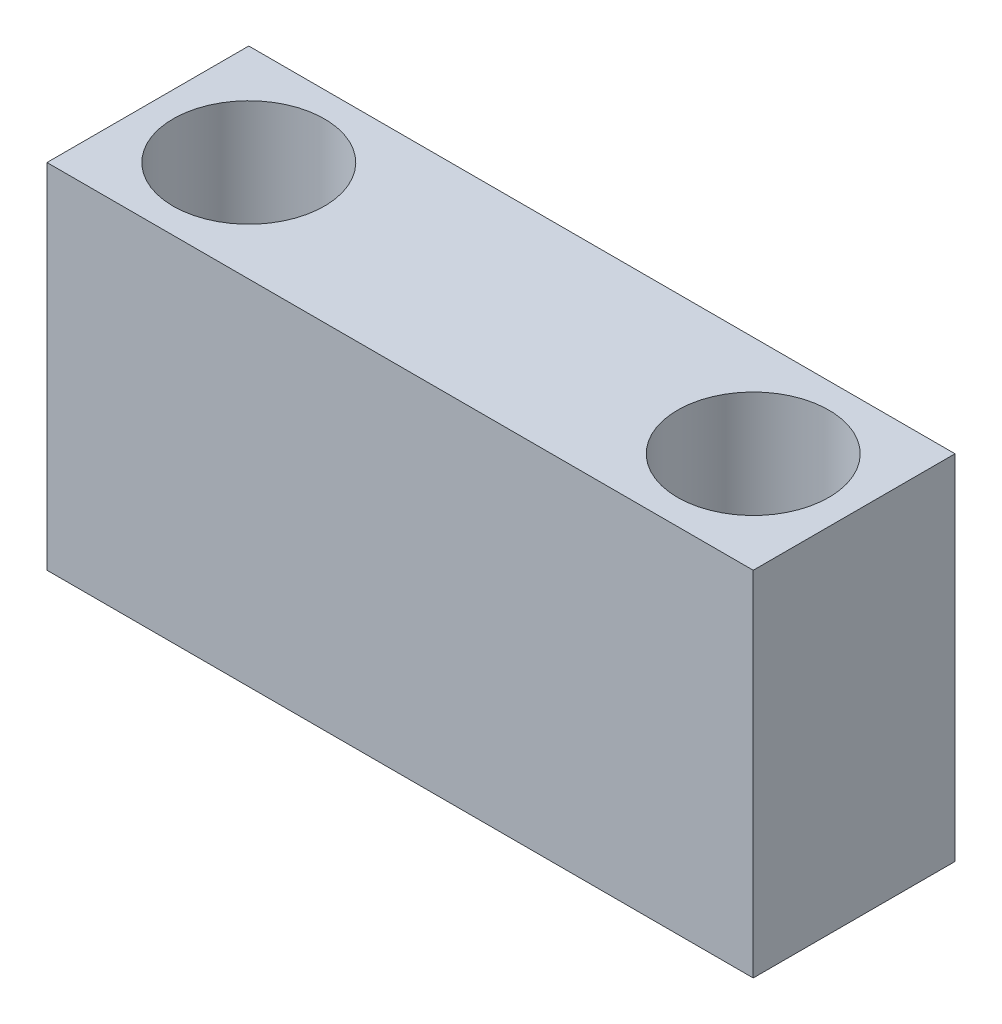
ISO-10303-21;
HEADER;
FILE_DESCRIPTION(('STEP AP214'),'2;1');
FILE_NAME('part.step','',(''),(''),'','','');
FILE_SCHEMA(('AUTOMOTIVE_DESIGN { 1 0 10303 214 1 1 1 1 }'));
ENDSEC;
DATA;
#1=APPLICATION_CONTEXT('core data for automotive mechanical design processes');
#2=APPLICATION_PROTOCOL_DEFINITION('international standard','automotive_design',2000,#1);
#3=PRODUCT_CONTEXT('',#1,'mechanical');
#4=PRODUCT('Part','Part','',(#3));
#5=PRODUCT_RELATED_PRODUCT_CATEGORY('part','',(#4));
#6=PRODUCT_DEFINITION_FORMATION('','',#4);
#7=PRODUCT_DEFINITION_CONTEXT('part definition',#1,'design');
#8=PRODUCT_DEFINITION('design','',#6,#7);
#9=PRODUCT_DEFINITION_SHAPE('','',#8);
#10=(LENGTH_UNIT() NAMED_UNIT(*) SI_UNIT(.MILLI.,.METRE.));
#11=(NAMED_UNIT(*) PLANE_ANGLE_UNIT() SI_UNIT($,.RADIAN.));
#12=(NAMED_UNIT(*) SI_UNIT($,.STERADIAN.) SOLID_ANGLE_UNIT());
#13=UNCERTAINTY_MEASURE_WITH_UNIT(LENGTH_MEASURE(1.E-05),#10,'distance_accuracy_value','');
#14=(GEOMETRIC_REPRESENTATION_CONTEXT(3) GLOBAL_UNCERTAINTY_ASSIGNED_CONTEXT((#13)) GLOBAL_UNIT_ASSIGNED_CONTEXT((#10,
#11,#12)) REPRESENTATION_CONTEXT('',''));
#15=CARTESIAN_POINT('',(0.,0.,0.));
#16=DIRECTION('',(0.,0.,1.));
#17=DIRECTION('',(1.,0.,0.));
#18=AXIS2_PLACEMENT_3D('',#15,#16,#17);
#19=CARTESIAN_POINT('',(35.,-17.5,10.));
#20=DIRECTION('',(-1.,0.,0.));
#21=DIRECTION('',(0.,0.,1.));
#22=AXIS2_PLACEMENT_3D('',#19,#20,#21);
#23=PLANE('',#22);
#24=DIRECTION('',(0.,1.,0.));
#25=VECTOR('',#24,1.);
#26=CARTESIAN_POINT('',(35.,-17.5,-10.));
#27=LINE('',#26,#25);
#28=CARTESIAN_POINT('',(35.,-17.5,-10.));
#29=VERTEX_POINT('',#28);
#30=CARTESIAN_POINT('',(35.,17.5,-10.));
#31=VERTEX_POINT('',#30);
#32=EDGE_CURVE('E98',#29,#31,#27,.T.);
#33=ORIENTED_EDGE('',*,*,#32,.T.);
#34=DIRECTION('',(0.,0.,-1.));
#35=VECTOR('',#34,1.);
#36=CARTESIAN_POINT('',(35.,17.5,10.));
#37=LINE('',#36,#35);
#38=CARTESIAN_POINT('',(35.,17.5,10.));
#39=VERTEX_POINT('',#38);
#40=EDGE_CURVE('E11',#39,#31,#37,.T.);
#41=ORIENTED_EDGE('',*,*,#40,.F.);
#42=DIRECTION('',(0.,1.,0.));
#43=VECTOR('',#42,1.);
#44=CARTESIAN_POINT('',(35.,-17.5,10.));
#45=LINE('',#44,#43);
#46=CARTESIAN_POINT('',(35.,-17.5,10.));
#47=VERTEX_POINT('',#46);
#48=EDGE_CURVE('E86',#47,#39,#45,.T.);
#49=ORIENTED_EDGE('',*,*,#48,.F.);
#50=DIRECTION('',(0.,0.,-1.));
#51=VECTOR('',#50,1.);
#52=CARTESIAN_POINT('',(35.,-17.5,10.));
#53=LINE('',#52,#51);
#54=EDGE_CURVE('E94',#47,#29,#53,.T.);
#55=ORIENTED_EDGE('',*,*,#54,.T.);
#56=EDGE_LOOP('',(#33,#41,#49,#55));
#57=FACE_BOUND('',#56,.T.);
#58=ADVANCED_FACE('F35',(#57),#23,.F.);
#59=CARTESIAN_POINT('',(-35.,17.5,10.));
#60=DIRECTION('',(0.,-1.,0.));
#61=DIRECTION('',(0.,0.,-1.));
#62=AXIS2_PLACEMENT_3D('',#59,#60,#61);
#63=PLANE('',#62);
#64=CARTESIAN_POINT('',(-25.,17.5,0.));
#65=DIRECTION('',(0.,1.,0.));
#66=DIRECTION('',(0.,0.,1.));
#67=AXIS2_PLACEMENT_3D('',#64,#65,#66);
#68=CIRCLE('',#67,7.5);
#69=CARTESIAN_POINT('',(-25.,17.5,7.5));
#70=VERTEX_POINT('',#69);
#71=EDGE_CURVE('E132',#70,#70,#68,.T.);
#72=ORIENTED_EDGE('',*,*,#71,.F.);
#73=EDGE_LOOP('',(#72));
#74=FACE_BOUND('',#73,.T.);
#75=CARTESIAN_POINT('',(25.,17.5,0.));
#76=DIRECTION('',(0.,1.,0.));
#77=DIRECTION('',(0.,0.,1.));
#78=AXIS2_PLACEMENT_3D('',#75,#76,#77);
#79=CIRCLE('',#78,7.5);
#80=CARTESIAN_POINT('',(25.,17.5,7.49999999999999));
#81=VERTEX_POINT('',#80);
#82=EDGE_CURVE('E120',#81,#81,#79,.T.);
#83=ORIENTED_EDGE('',*,*,#82,.F.);
#84=EDGE_LOOP('',(#83));
#85=FACE_BOUND('',#84,.T.);
#86=DIRECTION('',(-1.,0.,0.));
#87=VECTOR('',#86,1.);
#88=CARTESIAN_POINT('',(-35.,17.5,-10.));
#89=LINE('',#88,#87);
#90=CARTESIAN_POINT('',(-35.,17.5,-10.));
#91=VERTEX_POINT('',#90);
#92=EDGE_CURVE('E90',#31,#91,#89,.T.);
#93=ORIENTED_EDGE('',*,*,#92,.T.);
#94=DIRECTION('',(0.,0.,-1.));
#95=VECTOR('',#94,1.);
#96=CARTESIAN_POINT('',(-35.,17.5,10.));
#97=LINE('',#96,#95);
#98=CARTESIAN_POINT('',(-35.,17.5,10.));
#99=VERTEX_POINT('',#98);
#100=EDGE_CURVE('E43',#99,#91,#97,.T.);
#101=ORIENTED_EDGE('',*,*,#100,.F.);
#102=DIRECTION('',(-1.,0.,0.));
#103=VECTOR('',#102,1.);
#104=CARTESIAN_POINT('',(-35.,17.5,10.));
#105=LINE('',#104,#103);
#106=EDGE_CURVE('E81',#39,#99,#105,.T.);
#107=ORIENTED_EDGE('',*,*,#106,.F.);
#108=ORIENTED_EDGE('',*,*,#40,.T.);
#109=EDGE_LOOP('',(#93,#101,#107,#108));
#110=FACE_BOUND('',#109,.T.);
#111=ADVANCED_FACE('F89',(#74,#85,#110),#63,.F.);
#112=CARTESIAN_POINT('',(-35.,-17.5,10.));
#113=DIRECTION('',(1.,0.,0.));
#114=DIRECTION('',(0.,0.,-1.));
#115=AXIS2_PLACEMENT_3D('',#112,#113,#114);
#116=PLANE('',#115);
#117=DIRECTION('',(0.,-1.,0.));
#118=VECTOR('',#117,1.);
#119=CARTESIAN_POINT('',(-35.,-17.5,-10.));
#120=LINE('',#119,#118);
#121=CARTESIAN_POINT('',(-35.,-17.5,-10.));
#122=VERTEX_POINT('',#121);
#123=EDGE_CURVE('E68',#91,#122,#120,.T.);
#124=ORIENTED_EDGE('',*,*,#123,.T.);
#125=DIRECTION('',(0.,0.,-1.));
#126=VECTOR('',#125,1.);
#127=CARTESIAN_POINT('',(-35.,-17.5,10.));
#128=LINE('',#127,#126);
#129=CARTESIAN_POINT('',(-35.,-17.5,10.));
#130=VERTEX_POINT('',#129);
#131=EDGE_CURVE('E91',#130,#122,#128,.T.);
#132=ORIENTED_EDGE('',*,*,#131,.F.);
#133=DIRECTION('',(0.,-1.,0.));
#134=VECTOR('',#133,1.);
#135=CARTESIAN_POINT('',(-35.,-17.5,10.));
#136=LINE('',#135,#134);
#137=EDGE_CURVE('E84',#99,#130,#136,.T.);
#138=ORIENTED_EDGE('',*,*,#137,.F.);
#139=ORIENTED_EDGE('',*,*,#100,.T.);
#140=EDGE_LOOP('',(#124,#132,#138,#139));
#141=FACE_BOUND('',#140,.T.);
#142=ADVANCED_FACE('F92',(#141),#116,.F.);
#143=CARTESIAN_POINT('',(-35.,-17.5,10.));
#144=DIRECTION('',(0.,1.,0.));
#145=DIRECTION('',(0.,0.,1.));
#146=AXIS2_PLACEMENT_3D('',#143,#144,#145);
#147=PLANE('',#146);
#148=CARTESIAN_POINT('',(-25.,-17.5,0.));
#149=DIRECTION('',(0.,1.,0.));
#150=DIRECTION('',(0.,0.,1.));
#151=AXIS2_PLACEMENT_3D('',#148,#149,#150);
#152=CIRCLE('',#151,4.49999999999999);
#153=CARTESIAN_POINT('',(-25.,-17.5,4.49999999999999));
#154=VERTEX_POINT('',#153);
#155=EDGE_CURVE('E123',#154,#154,#152,.T.);
#156=ORIENTED_EDGE('',*,*,#155,.T.);
#157=EDGE_LOOP('',(#156));
#158=FACE_BOUND('',#157,.T.);
#159=CARTESIAN_POINT('',(25.,-17.5,0.));
#160=DIRECTION('',(0.,1.,0.));
#161=DIRECTION('',(0.,0.,1.));
#162=AXIS2_PLACEMENT_3D('',#159,#160,#161);
#163=CIRCLE('',#162,4.49999999999999);
#164=CARTESIAN_POINT('',(25.,-17.5,4.49999999999998));
#165=VERTEX_POINT('',#164);
#166=EDGE_CURVE('E101',#165,#165,#163,.T.);
#167=ORIENTED_EDGE('',*,*,#166,.T.);
#168=EDGE_LOOP('',(#167));
#169=FACE_BOUND('',#168,.T.);
#170=DIRECTION('',(1.,0.,0.));
#171=VECTOR('',#170,1.);
#172=CARTESIAN_POINT('',(-35.,-17.5,-10.));
#173=LINE('',#172,#171);
#174=EDGE_CURVE('E74',#122,#29,#173,.T.);
#175=ORIENTED_EDGE('',*,*,#174,.T.);
#176=ORIENTED_EDGE('',*,*,#54,.F.);
#177=DIRECTION('',(1.,0.,0.));
#178=VECTOR('',#177,1.);
#179=CARTESIAN_POINT('',(-35.,-17.5,10.));
#180=LINE('',#179,#178);
#181=EDGE_CURVE('E51',#130,#47,#180,.T.);
#182=ORIENTED_EDGE('',*,*,#181,.F.);
#183=ORIENTED_EDGE('',*,*,#131,.T.);
#184=EDGE_LOOP('',(#175,#176,#182,#183));
#185=FACE_BOUND('',#184,.T.);
#186=ADVANCED_FACE('F106',(#158,#169,#185),#147,.F.);
#187=CARTESIAN_POINT('',(0.,0.,10.));
#188=DIRECTION('',(0.,0.,-1.));
#189=DIRECTION('',(-1.,0.,0.));
#190=AXIS2_PLACEMENT_3D('',#187,#188,#189);
#191=PLANE('',#190);
#192=ORIENTED_EDGE('',*,*,#48,.T.);
#193=ORIENTED_EDGE('',*,*,#106,.T.);
#194=ORIENTED_EDGE('',*,*,#137,.T.);
#195=ORIENTED_EDGE('',*,*,#181,.T.);
#196=EDGE_LOOP('',(#192,#193,#194,#195));
#197=FACE_BOUND('',#196,.T.);
#198=ADVANCED_FACE('F82',(#197),#191,.F.);
#199=CARTESIAN_POINT('',(0.,0.,-10.));
#200=DIRECTION('',(0.,0.,-1.));
#201=DIRECTION('',(-1.,0.,0.));
#202=AXIS2_PLACEMENT_3D('',#199,#200,#201);
#203=PLANE('',#202);
#204=ORIENTED_EDGE('',*,*,#32,.F.);
#205=ORIENTED_EDGE('',*,*,#174,.F.);
#206=ORIENTED_EDGE('',*,*,#123,.F.);
#207=ORIENTED_EDGE('',*,*,#92,.F.);
#208=EDGE_LOOP('',(#204,#205,#206,#207));
#209=FACE_BOUND('',#208,.T.);
#210=ADVANCED_FACE('F109',(#209),#203,.T.);
#211=CARTESIAN_POINT('',(25.,17.5,0.));
#212=DIRECTION('',(0.,1.,0.));
#213=DIRECTION('',(0.,0.,1.));
#214=AXIS2_PLACEMENT_3D('',#211,#212,#213);
#215=CYLINDRICAL_SURFACE('',#214,4.5);
#216=ORIENTED_EDGE('',*,*,#166,.F.);
#217=EDGE_LOOP('',(#216));
#218=FACE_BOUND('',#217,.T.);
#219=CARTESIAN_POINT('',(25.,5.50000000000001,0.));
#220=DIRECTION('',(0.,1.,0.));
#221=DIRECTION('',(0.,0.,1.));
#222=AXIS2_PLACEMENT_3D('',#219,#220,#221);
#223=CIRCLE('',#222,4.5);
#224=CARTESIAN_POINT('',(25.,5.50000000000001,4.49999999999999));
#225=VERTEX_POINT('',#224);
#226=EDGE_CURVE('E114',#225,#225,#223,.T.);
#227=ORIENTED_EDGE('',*,*,#226,.T.);
#228=EDGE_LOOP('',(#227));
#229=FACE_BOUND('',#228,.T.);
#230=ADVANCED_FACE('F155',(#218,#229),#215,.F.);
#231=CARTESIAN_POINT('',(29.5,5.50000000000001,0.));
#232=DIRECTION('',(0.,-1.,0.));
#233=DIRECTION('',(0.,0.,-1.));
#234=AXIS2_PLACEMENT_3D('',#231,#232,#233);
#235=PLANE('',#234);
#236=ORIENTED_EDGE('',*,*,#226,.F.);
#237=EDGE_LOOP('',(#236));
#238=FACE_BOUND('',#237,.T.);
#239=CARTESIAN_POINT('',(25.,5.50000000000001,0.));
#240=DIRECTION('',(0.,1.,0.));
#241=DIRECTION('',(0.,0.,1.));
#242=AXIS2_PLACEMENT_3D('',#239,#240,#241);
#243=CIRCLE('',#242,7.5);
#244=CARTESIAN_POINT('',(25.,5.50000000000001,7.49999999999999));
#245=VERTEX_POINT('',#244);
#246=EDGE_CURVE('E117',#245,#245,#243,.T.);
#247=ORIENTED_EDGE('',*,*,#246,.T.);
#248=EDGE_LOOP('',(#247));
#249=FACE_BOUND('',#248,.T.);
#250=ADVANCED_FACE('F145',(#238,#249),#235,.F.);
#251=CARTESIAN_POINT('',(25.,17.5,0.));
#252=DIRECTION('',(0.,1.,0.));
#253=DIRECTION('',(0.,0.,1.));
#254=AXIS2_PLACEMENT_3D('',#251,#252,#253);
#255=CYLINDRICAL_SURFACE('',#254,7.5);
#256=ORIENTED_EDGE('',*,*,#246,.F.);
#257=EDGE_LOOP('',(#256));
#258=FACE_BOUND('',#257,.T.);
#259=ORIENTED_EDGE('',*,*,#82,.T.);
#260=EDGE_LOOP('',(#259));
#261=FACE_BOUND('',#260,.T.);
#262=ADVANCED_FACE('F142',(#258,#261),#255,.F.);
#263=CARTESIAN_POINT('',(-25.,17.5,0.));
#264=DIRECTION('',(0.,1.,0.));
#265=DIRECTION('',(0.,0.,1.));
#266=AXIS2_PLACEMENT_3D('',#263,#264,#265);
#267=CYLINDRICAL_SURFACE('',#266,4.5);
#268=ORIENTED_EDGE('',*,*,#155,.F.);
#269=EDGE_LOOP('',(#268));
#270=FACE_BOUND('',#269,.T.);
#271=CARTESIAN_POINT('',(-25.,5.50000000000001,0.));
#272=DIRECTION('',(0.,1.,0.));
#273=DIRECTION('',(0.,0.,1.));
#274=AXIS2_PLACEMENT_3D('',#271,#272,#273);
#275=CIRCLE('',#274,4.5);
#276=CARTESIAN_POINT('',(-25.,5.50000000000001,4.5));
#277=VERTEX_POINT('',#276);
#278=EDGE_CURVE('E126',#277,#277,#275,.T.);
#279=ORIENTED_EDGE('',*,*,#278,.T.);
#280=EDGE_LOOP('',(#279));
#281=FACE_BOUND('',#280,.T.);
#282=ADVANCED_FACE('F144',(#270,#281),#267,.F.);
#283=CARTESIAN_POINT('',(-20.5,5.50000000000001,0.));
#284=DIRECTION('',(0.,-1.,0.));
#285=DIRECTION('',(0.,0.,-1.));
#286=AXIS2_PLACEMENT_3D('',#283,#284,#285);
#287=PLANE('',#286);
#288=ORIENTED_EDGE('',*,*,#278,.F.);
#289=EDGE_LOOP('',(#288));
#290=FACE_BOUND('',#289,.T.);
#291=CARTESIAN_POINT('',(-25.,5.50000000000001,0.));
#292=DIRECTION('',(0.,1.,0.));
#293=DIRECTION('',(0.,0.,1.));
#294=AXIS2_PLACEMENT_3D('',#291,#292,#293);
#295=CIRCLE('',#294,7.5);
#296=CARTESIAN_POINT('',(-25.,5.50000000000001,7.5));
#297=VERTEX_POINT('',#296);
#298=EDGE_CURVE('E129',#297,#297,#295,.T.);
#299=ORIENTED_EDGE('',*,*,#298,.T.);
#300=EDGE_LOOP('',(#299));
#301=FACE_BOUND('',#300,.T.);
#302=ADVANCED_FACE('F152',(#290,#301),#287,.F.);
#303=CARTESIAN_POINT('',(-25.,17.5,0.));
#304=DIRECTION('',(0.,1.,0.));
#305=DIRECTION('',(0.,0.,1.));
#306=AXIS2_PLACEMENT_3D('',#303,#304,#305);
#307=CYLINDRICAL_SURFACE('',#306,7.5);
#308=ORIENTED_EDGE('',*,*,#298,.F.);
#309=EDGE_LOOP('',(#308));
#310=FACE_BOUND('',#309,.T.);
#311=ORIENTED_EDGE('',*,*,#71,.T.);
#312=EDGE_LOOP('',(#311));
#313=FACE_BOUND('',#312,.T.);
#314=ADVANCED_FACE('F136',(#310,#313),#307,.F.);
#315=CLOSED_SHELL('',(#58,#111,#142,#186,#198,#210,#230,#250,#262,#282,#302,#314));
#316=MANIFOLD_SOLID_BREP('B2',#315);
#317=ADVANCED_BREP_SHAPE_REPRESENTATION('',(#18,#316),#14);
#318=SHAPE_DEFINITION_REPRESENTATION(#9,#317);
ENDSEC;
END-ISO-10303-21;
